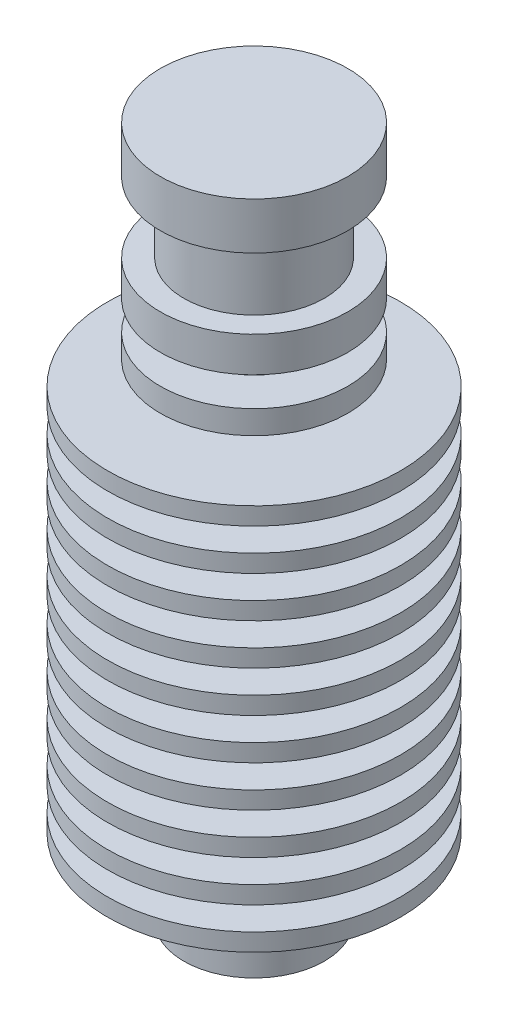
ISO-10303-21;
HEADER;
FILE_DESCRIPTION(('STEP AP214'),'2;1');
FILE_NAME('part.step','',(''),(''),'','','');
FILE_SCHEMA(('AUTOMOTIVE_DESIGN { 1 0 10303 214 1 1 1 1 }'));
ENDSEC;
DATA;
#1=APPLICATION_CONTEXT('core data for automotive mechanical design processes');
#2=APPLICATION_PROTOCOL_DEFINITION('international standard','automotive_design',2000,#1);
#3=PRODUCT_CONTEXT('',#1,'mechanical');
#4=PRODUCT('Part','Part','',(#3));
#5=PRODUCT_RELATED_PRODUCT_CATEGORY('part','',(#4));
#6=PRODUCT_DEFINITION_FORMATION('','',#4);
#7=PRODUCT_DEFINITION_CONTEXT('part definition',#1,'design');
#8=PRODUCT_DEFINITION('design','',#6,#7);
#9=PRODUCT_DEFINITION_SHAPE('','',#8);
#10=(LENGTH_UNIT() NAMED_UNIT(*) SI_UNIT(.MILLI.,.METRE.));
#11=(NAMED_UNIT(*) PLANE_ANGLE_UNIT() SI_UNIT($,.RADIAN.));
#12=(NAMED_UNIT(*) SI_UNIT($,.STERADIAN.) SOLID_ANGLE_UNIT());
#13=UNCERTAINTY_MEASURE_WITH_UNIT(LENGTH_MEASURE(1.E-05),#10,'distance_accuracy_value','');
#14=(GEOMETRIC_REPRESENTATION_CONTEXT(3) GLOBAL_UNCERTAINTY_ASSIGNED_CONTEXT((#13)) GLOBAL_UNIT_ASSIGNED_CONTEXT((#10,
#11,#12)) REPRESENTATION_CONTEXT('',''));
#15=CARTESIAN_POINT('',(0.,0.,0.));
#16=DIRECTION('',(0.,0.,1.));
#17=DIRECTION('',(1.,0.,0.));
#18=AXIS2_PLACEMENT_3D('',#15,#16,#17);
#19=CARTESIAN_POINT('',(0.,-29.5,0.));
#20=DIRECTION('',(0.,-1.,0.));
#21=DIRECTION('',(1.,0.,0.));
#22=AXIS2_PLACEMENT_3D('',#19,#20,#21);
#23=CYLINDRICAL_SURFACE('',#22,8.);
#24=CARTESIAN_POINT('',(0.,29.5,0.));
#25=DIRECTION('',(0.,-1.,0.));
#26=DIRECTION('',(1.,0.,0.));
#27=AXIS2_PLACEMENT_3D('',#24,#25,#26);
#28=CIRCLE('',#27,8.);
#29=CARTESIAN_POINT('',(7.99999999999999,29.5,0.));
#30=VERTEX_POINT('',#29);
#31=EDGE_CURVE('E200',#30,#30,#28,.T.);
#32=ORIENTED_EDGE('',*,*,#31,.T.);
#33=EDGE_LOOP('',(#32));
#34=FACE_BOUND('',#33,.T.);
#35=CARTESIAN_POINT('',(0.,25.5,0.));
#36=DIRECTION('',(0.,-1.,0.));
#37=DIRECTION('',(1.,0.,0.));
#38=AXIS2_PLACEMENT_3D('',#35,#36,#37);
#39=CIRCLE('',#38,8.);
#40=CARTESIAN_POINT('',(8.,25.5,0.));
#41=VERTEX_POINT('',#40);
#42=EDGE_CURVE('E10',#41,#41,#39,.T.);
#43=ORIENTED_EDGE('',*,*,#42,.F.);
#44=EDGE_LOOP('',(#43));
#45=FACE_BOUND('',#44,.T.);
#46=ADVANCED_FACE('F34',(#34,#45),#23,.T.);
#47=CARTESIAN_POINT('',(8.,25.5,0.));
#48=DIRECTION('',(0.,-1.,0.));
#49=DIRECTION('',(1.,0.,0.));
#50=AXIS2_PLACEMENT_3D('',#47,#48,#49);
#51=PLANE('',#50);
#52=ORIENTED_EDGE('',*,*,#42,.T.);
#53=EDGE_LOOP('',(#52));
#54=FACE_BOUND('',#53,.T.);
#55=CARTESIAN_POINT('',(0.,25.5,0.));
#56=DIRECTION('',(0.,-1.,0.));
#57=DIRECTION('',(1.,0.,0.));
#58=AXIS2_PLACEMENT_3D('',#55,#56,#57);
#59=CIRCLE('',#58,6.);
#60=CARTESIAN_POINT('',(5.99999999999999,25.5,0.));
#61=VERTEX_POINT('',#60);
#62=EDGE_CURVE('E40',#61,#61,#59,.T.);
#63=ORIENTED_EDGE('',*,*,#62,.F.);
#64=EDGE_LOOP('',(#63));
#65=FACE_BOUND('',#64,.T.);
#66=ADVANCED_FACE('F217',(#54,#65),#51,.T.);
#67=CARTESIAN_POINT('',(0.,-29.5,0.));
#68=DIRECTION('',(0.,-1.,0.));
#69=DIRECTION('',(1.,0.,0.));
#70=AXIS2_PLACEMENT_3D('',#67,#68,#69);
#71=CYLINDRICAL_SURFACE('',#70,6.);
#72=ORIENTED_EDGE('',*,*,#62,.T.);
#73=EDGE_LOOP('',(#72));
#74=FACE_BOUND('',#73,.T.);
#75=CARTESIAN_POINT('',(0.,19.5,0.));
#76=DIRECTION('',(0.,-1.,0.));
#77=DIRECTION('',(1.,0.,0.));
#78=AXIS2_PLACEMENT_3D('',#75,#76,#77);
#79=CIRCLE('',#78,6.);
#80=CARTESIAN_POINT('',(6.,19.5,0.));
#81=VERTEX_POINT('',#80);
#82=EDGE_CURVE('E44',#81,#81,#79,.T.);
#83=ORIENTED_EDGE('',*,*,#82,.F.);
#84=EDGE_LOOP('',(#83));
#85=FACE_BOUND('',#84,.T.);
#86=ADVANCED_FACE('F221',(#74,#85),#71,.T.);
#87=CARTESIAN_POINT('',(6.,19.5,0.));
#88=DIRECTION('',(0.,1.,0.));
#89=DIRECTION('',(-1.,0.,0.));
#90=AXIS2_PLACEMENT_3D('',#87,#88,#89);
#91=PLANE('',#90);
#92=ORIENTED_EDGE('',*,*,#82,.T.);
#93=EDGE_LOOP('',(#92));
#94=FACE_BOUND('',#93,.T.);
#95=CARTESIAN_POINT('',(0.,19.5,0.));
#96=DIRECTION('',(0.,-1.,0.));
#97=DIRECTION('',(1.,0.,0.));
#98=AXIS2_PLACEMENT_3D('',#95,#96,#97);
#99=CIRCLE('',#98,8.00000000000001);
#100=CARTESIAN_POINT('',(8.,19.5,0.));
#101=VERTEX_POINT('',#100);
#102=EDGE_CURVE('E48',#101,#101,#99,.T.);
#103=ORIENTED_EDGE('',*,*,#102,.F.);
#104=EDGE_LOOP('',(#103));
#105=FACE_BOUND('',#104,.T.);
#106=ADVANCED_FACE('F225',(#94,#105),#91,.T.);
#107=CARTESIAN_POINT('',(0.,-29.5,0.));
#108=DIRECTION('',(0.,-1.,0.));
#109=DIRECTION('',(1.,0.,0.));
#110=AXIS2_PLACEMENT_3D('',#107,#108,#109);
#111=CYLINDRICAL_SURFACE('',#110,8.00000000000001);
#112=ORIENTED_EDGE('',*,*,#102,.T.);
#113=EDGE_LOOP('',(#112));
#114=FACE_BOUND('',#113,.T.);
#115=CARTESIAN_POINT('',(0.,16.5,0.));
#116=DIRECTION('',(0.,-1.,0.));
#117=DIRECTION('',(1.,0.,0.));
#118=AXIS2_PLACEMENT_3D('',#115,#116,#117);
#119=CIRCLE('',#118,8.00000000000001);
#120=CARTESIAN_POINT('',(8.,16.5,0.));
#121=VERTEX_POINT('',#120);
#122=EDGE_CURVE('E53',#121,#121,#119,.T.);
#123=ORIENTED_EDGE('',*,*,#122,.F.);
#124=EDGE_LOOP('',(#123));
#125=FACE_BOUND('',#124,.T.);
#126=ADVANCED_FACE('F231',(#114,#125),#111,.T.);
#127=CARTESIAN_POINT('',(8.,16.5,0.));
#128=DIRECTION('',(0.,-1.,0.));
#129=DIRECTION('',(1.,0.,0.));
#130=AXIS2_PLACEMENT_3D('',#127,#128,#129);
#131=PLANE('',#130);
#132=ORIENTED_EDGE('',*,*,#122,.T.);
#133=EDGE_LOOP('',(#132));
#134=FACE_BOUND('',#133,.T.);
#135=CARTESIAN_POINT('',(0.,16.5,0.));
#136=DIRECTION('',(0.,-1.,0.));
#137=DIRECTION('',(1.,0.,0.));
#138=AXIS2_PLACEMENT_3D('',#135,#136,#137);
#139=CIRCLE('',#138,4.5);
#140=CARTESIAN_POINT('',(4.5,16.5,0.));
#141=VERTEX_POINT('',#140);
#142=EDGE_CURVE('E56',#141,#141,#139,.T.);
#143=ORIENTED_EDGE('',*,*,#142,.F.);
#144=EDGE_LOOP('',(#143));
#145=FACE_BOUND('',#144,.T.);
#146=ADVANCED_FACE('F235',(#134,#145),#131,.T.);
#147=CARTESIAN_POINT('',(0.,-29.5,0.));
#148=DIRECTION('',(0.,-1.,0.));
#149=DIRECTION('',(1.,0.,0.));
#150=AXIS2_PLACEMENT_3D('',#147,#148,#149);
#151=CYLINDRICAL_SURFACE('',#150,4.5);
#152=ORIENTED_EDGE('',*,*,#142,.T.);
#153=EDGE_LOOP('',(#152));
#154=FACE_BOUND('',#153,.T.);
#155=CARTESIAN_POINT('',(0.,14.,0.));
#156=DIRECTION('',(0.,-1.,0.));
#157=DIRECTION('',(1.,0.,0.));
#158=AXIS2_PLACEMENT_3D('',#155,#156,#157);
#159=CIRCLE('',#158,4.5);
#160=CARTESIAN_POINT('',(4.5,14.,0.));
#161=VERTEX_POINT('',#160);
#162=EDGE_CURVE('E59',#161,#161,#159,.T.);
#163=ORIENTED_EDGE('',*,*,#162,.F.);
#164=EDGE_LOOP('',(#163));
#165=FACE_BOUND('',#164,.T.);
#166=ADVANCED_FACE('F239',(#154,#165),#151,.T.);
#167=CARTESIAN_POINT('',(4.5,14.,0.));
#168=DIRECTION('',(0.,1.,0.));
#169=DIRECTION('',(-1.,0.,0.));
#170=AXIS2_PLACEMENT_3D('',#167,#168,#169);
#171=PLANE('',#170);
#172=ORIENTED_EDGE('',*,*,#162,.T.);
#173=EDGE_LOOP('',(#172));
#174=FACE_BOUND('',#173,.T.);
#175=CARTESIAN_POINT('',(0.,14.,0.));
#176=DIRECTION('',(0.,-1.,0.));
#177=DIRECTION('',(1.,0.,0.));
#178=AXIS2_PLACEMENT_3D('',#175,#176,#177);
#179=CIRCLE('',#178,8.00000000000001);
#180=CARTESIAN_POINT('',(8.,14.,0.));
#181=VERTEX_POINT('',#180);
#182=EDGE_CURVE('E62',#181,#181,#179,.T.);
#183=ORIENTED_EDGE('',*,*,#182,.F.);
#184=EDGE_LOOP('',(#183));
#185=FACE_BOUND('',#184,.T.);
#186=ADVANCED_FACE('F243',(#174,#185),#171,.T.);
#187=CARTESIAN_POINT('',(0.,-29.5,0.));
#188=DIRECTION('',(0.,-1.,0.));
#189=DIRECTION('',(1.,0.,0.));
#190=AXIS2_PLACEMENT_3D('',#187,#188,#189);
#191=CYLINDRICAL_SURFACE('',#190,8.00000000000001);
#192=ORIENTED_EDGE('',*,*,#182,.T.);
#193=EDGE_LOOP('',(#192));
#194=FACE_BOUND('',#193,.T.);
#195=CARTESIAN_POINT('',(0.,12.,0.));
#196=DIRECTION('',(0.,-1.,0.));
#197=DIRECTION('',(1.,0.,0.));
#198=AXIS2_PLACEMENT_3D('',#195,#196,#197);
#199=CIRCLE('',#198,8.00000000000001);
#200=CARTESIAN_POINT('',(8.,12.,0.));
#201=VERTEX_POINT('',#200);
#202=EDGE_CURVE('E65',#201,#201,#199,.T.);
#203=ORIENTED_EDGE('',*,*,#202,.F.);
#204=EDGE_LOOP('',(#203));
#205=FACE_BOUND('',#204,.T.);
#206=ADVANCED_FACE('F247',(#194,#205),#191,.T.);
#207=CARTESIAN_POINT('',(8.,12.,0.));
#208=DIRECTION('',(0.,-1.,0.));
#209=DIRECTION('',(1.,0.,0.));
#210=AXIS2_PLACEMENT_3D('',#207,#208,#209);
#211=PLANE('',#210);
#212=ORIENTED_EDGE('',*,*,#202,.T.);
#213=EDGE_LOOP('',(#212));
#214=FACE_BOUND('',#213,.T.);
#215=CARTESIAN_POINT('',(0.,12.,0.));
#216=DIRECTION('',(0.,-1.,0.));
#217=DIRECTION('',(1.,0.,0.));
#218=AXIS2_PLACEMENT_3D('',#215,#216,#217);
#219=CIRCLE('',#218,4.5);
#220=CARTESIAN_POINT('',(4.49999999999999,12.,0.));
#221=VERTEX_POINT('',#220);
#222=EDGE_CURVE('E68',#221,#221,#219,.T.);
#223=ORIENTED_EDGE('',*,*,#222,.F.);
#224=EDGE_LOOP('',(#223));
#225=FACE_BOUND('',#224,.T.);
#226=ADVANCED_FACE('F251',(#214,#225),#211,.T.);
#227=CARTESIAN_POINT('',(0.,-29.5,0.));
#228=DIRECTION('',(0.,-1.,0.));
#229=DIRECTION('',(1.,0.,0.));
#230=AXIS2_PLACEMENT_3D('',#227,#228,#229);
#231=CYLINDRICAL_SURFACE('',#230,4.5);
#232=ORIENTED_EDGE('',*,*,#222,.T.);
#233=EDGE_LOOP('',(#232));
#234=FACE_BOUND('',#233,.T.);
#235=CARTESIAN_POINT('',(0.,10.,0.));
#236=DIRECTION('',(0.,-1.,0.));
#237=DIRECTION('',(1.,0.,0.));
#238=AXIS2_PLACEMENT_3D('',#235,#236,#237);
#239=CIRCLE('',#238,4.5);
#240=CARTESIAN_POINT('',(4.49999999999999,10.,0.));
#241=VERTEX_POINT('',#240);
#242=EDGE_CURVE('E71',#241,#241,#239,.T.);
#243=ORIENTED_EDGE('',*,*,#242,.F.);
#244=EDGE_LOOP('',(#243));
#245=FACE_BOUND('',#244,.T.);
#246=ADVANCED_FACE('F255',(#234,#245),#231,.T.);
#247=CARTESIAN_POINT('',(4.49999999999999,10.,0.));
#248=DIRECTION('',(0.,1.,0.));
#249=DIRECTION('',(-1.,0.,0.));
#250=AXIS2_PLACEMENT_3D('',#247,#248,#249);
#251=PLANE('',#250);
#252=ORIENTED_EDGE('',*,*,#242,.T.);
#253=EDGE_LOOP('',(#252));
#254=FACE_BOUND('',#253,.T.);
#255=CARTESIAN_POINT('',(0.,10.,0.));
#256=DIRECTION('',(0.,-1.,0.));
#257=DIRECTION('',(1.,0.,0.));
#258=AXIS2_PLACEMENT_3D('',#255,#256,#257);
#259=CIRCLE('',#258,12.5);
#260=CARTESIAN_POINT('',(12.5,10.,0.));
#261=VERTEX_POINT('',#260);
#262=EDGE_CURVE('E74',#261,#261,#259,.T.);
#263=ORIENTED_EDGE('',*,*,#262,.F.);
#264=EDGE_LOOP('',(#263));
#265=FACE_BOUND('',#264,.T.);
#266=ADVANCED_FACE('F259',(#254,#265),#251,.T.);
#267=CARTESIAN_POINT('',(0.,-29.5,0.));
#268=DIRECTION('',(0.,-1.,0.));
#269=DIRECTION('',(1.,0.,0.));
#270=AXIS2_PLACEMENT_3D('',#267,#268,#269);
#271=CYLINDRICAL_SURFACE('',#270,12.5);
#272=ORIENTED_EDGE('',*,*,#262,.T.);
#273=EDGE_LOOP('',(#272));
#274=FACE_BOUND('',#273,.T.);
#275=CARTESIAN_POINT('',(0.,8.50000000000001,0.));
#276=DIRECTION('',(0.,-1.,0.));
#277=DIRECTION('',(1.,0.,0.));
#278=AXIS2_PLACEMENT_3D('',#275,#276,#277);
#279=CIRCLE('',#278,12.5);
#280=CARTESIAN_POINT('',(12.5,8.50000000000001,0.));
#281=VERTEX_POINT('',#280);
#282=EDGE_CURVE('E77',#281,#281,#279,.T.);
#283=ORIENTED_EDGE('',*,*,#282,.F.);
#284=EDGE_LOOP('',(#283));
#285=FACE_BOUND('',#284,.T.);
#286=ADVANCED_FACE('F263',(#274,#285),#271,.T.);
#287=CARTESIAN_POINT('',(12.5,8.50000000000001,0.));
#288=DIRECTION('',(0.,-1.,0.));
#289=DIRECTION('',(1.,0.,0.));
#290=AXIS2_PLACEMENT_3D('',#287,#288,#289);
#291=PLANE('',#290);
#292=ORIENTED_EDGE('',*,*,#282,.T.);
#293=EDGE_LOOP('',(#292));
#294=FACE_BOUND('',#293,.T.);
#295=CARTESIAN_POINT('',(0.,8.5,0.));
#296=DIRECTION('',(0.,-1.,0.));
#297=DIRECTION('',(1.,0.,0.));
#298=AXIS2_PLACEMENT_3D('',#295,#296,#297);
#299=CIRCLE('',#298,4.5);
#300=CARTESIAN_POINT('',(4.5,8.5,0.));
#301=VERTEX_POINT('',#300);
#302=EDGE_CURVE('E80',#301,#301,#299,.T.);
#303=ORIENTED_EDGE('',*,*,#302,.F.);
#304=EDGE_LOOP('',(#303));
#305=FACE_BOUND('',#304,.T.);
#306=ADVANCED_FACE('F267',(#294,#305),#291,.T.);
#307=CARTESIAN_POINT('',(0.,-29.5,0.));
#308=DIRECTION('',(0.,-1.,0.));
#309=DIRECTION('',(1.,0.,0.));
#310=AXIS2_PLACEMENT_3D('',#307,#308,#309);
#311=CYLINDRICAL_SURFACE('',#310,4.5);
#312=ORIENTED_EDGE('',*,*,#302,.T.);
#313=EDGE_LOOP('',(#312));
#314=FACE_BOUND('',#313,.T.);
#315=CARTESIAN_POINT('',(0.,6.5,0.));
#316=DIRECTION('',(0.,-1.,0.));
#317=DIRECTION('',(1.,0.,0.));
#318=AXIS2_PLACEMENT_3D('',#315,#316,#317);
#319=CIRCLE('',#318,4.5);
#320=CARTESIAN_POINT('',(4.5,6.5,0.));
#321=VERTEX_POINT('',#320);
#322=EDGE_CURVE('E83',#321,#321,#319,.T.);
#323=ORIENTED_EDGE('',*,*,#322,.F.);
#324=EDGE_LOOP('',(#323));
#325=FACE_BOUND('',#324,.T.);
#326=ADVANCED_FACE('F271',(#314,#325),#311,.T.);
#327=CARTESIAN_POINT('',(4.5,6.5,0.));
#328=DIRECTION('',(0.,1.,0.));
#329=DIRECTION('',(-1.,0.,0.));
#330=AXIS2_PLACEMENT_3D('',#327,#328,#329);
#331=PLANE('',#330);
#332=ORIENTED_EDGE('',*,*,#322,.T.);
#333=EDGE_LOOP('',(#332));
#334=FACE_BOUND('',#333,.T.);
#335=CARTESIAN_POINT('',(0.,6.5,0.));
#336=DIRECTION('',(0.,-1.,0.));
#337=DIRECTION('',(1.,0.,0.));
#338=AXIS2_PLACEMENT_3D('',#335,#336,#337);
#339=CIRCLE('',#338,12.5);
#340=CARTESIAN_POINT('',(12.5,6.5,0.));
#341=VERTEX_POINT('',#340);
#342=EDGE_CURVE('E86',#341,#341,#339,.T.);
#343=ORIENTED_EDGE('',*,*,#342,.F.);
#344=EDGE_LOOP('',(#343));
#345=FACE_BOUND('',#344,.T.);
#346=ADVANCED_FACE('F275',(#334,#345),#331,.T.);
#347=CARTESIAN_POINT('',(0.,-29.5,0.));
#348=DIRECTION('',(0.,-1.,0.));
#349=DIRECTION('',(1.,0.,0.));
#350=AXIS2_PLACEMENT_3D('',#347,#348,#349);
#351=CYLINDRICAL_SURFACE('',#350,12.5);
#352=ORIENTED_EDGE('',*,*,#342,.T.);
#353=EDGE_LOOP('',(#352));
#354=FACE_BOUND('',#353,.T.);
#355=CARTESIAN_POINT('',(0.,5.,0.));
#356=DIRECTION('',(0.,-1.,0.));
#357=DIRECTION('',(1.,0.,0.));
#358=AXIS2_PLACEMENT_3D('',#355,#356,#357);
#359=CIRCLE('',#358,12.5);
#360=CARTESIAN_POINT('',(12.5,5.,0.));
#361=VERTEX_POINT('',#360);
#362=EDGE_CURVE('E89',#361,#361,#359,.T.);
#363=ORIENTED_EDGE('',*,*,#362,.F.);
#364=EDGE_LOOP('',(#363));
#365=FACE_BOUND('',#364,.T.);
#366=ADVANCED_FACE('F279',(#354,#365),#351,.T.);
#367=CARTESIAN_POINT('',(12.5,5.,0.));
#368=DIRECTION('',(0.,-1.,0.));
#369=DIRECTION('',(1.,0.,0.));
#370=AXIS2_PLACEMENT_3D('',#367,#368,#369);
#371=PLANE('',#370);
#372=ORIENTED_EDGE('',*,*,#362,.T.);
#373=EDGE_LOOP('',(#372));
#374=FACE_BOUND('',#373,.T.);
#375=CARTESIAN_POINT('',(0.,5.,0.));
#376=DIRECTION('',(0.,-1.,0.));
#377=DIRECTION('',(1.,0.,0.));
#378=AXIS2_PLACEMENT_3D('',#375,#376,#377);
#379=CIRCLE('',#378,4.5);
#380=CARTESIAN_POINT('',(4.5,5.,0.));
#381=VERTEX_POINT('',#380);
#382=EDGE_CURVE('E92',#381,#381,#379,.T.);
#383=ORIENTED_EDGE('',*,*,#382,.F.);
#384=EDGE_LOOP('',(#383));
#385=FACE_BOUND('',#384,.T.);
#386=ADVANCED_FACE('F283',(#374,#385),#371,.T.);
#387=CARTESIAN_POINT('',(0.,-29.5,0.));
#388=DIRECTION('',(0.,-1.,0.));
#389=DIRECTION('',(1.,0.,0.));
#390=AXIS2_PLACEMENT_3D('',#387,#388,#389);
#391=CYLINDRICAL_SURFACE('',#390,4.5);
#392=ORIENTED_EDGE('',*,*,#382,.T.);
#393=EDGE_LOOP('',(#392));
#394=FACE_BOUND('',#393,.T.);
#395=CARTESIAN_POINT('',(0.,3.,0.));
#396=DIRECTION('',(0.,-1.,0.));
#397=DIRECTION('',(1.,0.,0.));
#398=AXIS2_PLACEMENT_3D('',#395,#396,#397);
#399=CIRCLE('',#398,4.5);
#400=CARTESIAN_POINT('',(4.5,3.,0.));
#401=VERTEX_POINT('',#400);
#402=EDGE_CURVE('E95',#401,#401,#399,.T.);
#403=ORIENTED_EDGE('',*,*,#402,.F.);
#404=EDGE_LOOP('',(#403));
#405=FACE_BOUND('',#404,.T.);
#406=ADVANCED_FACE('F287',(#394,#405),#391,.T.);
#407=CARTESIAN_POINT('',(4.5,3.,0.));
#408=DIRECTION('',(0.,1.,0.));
#409=DIRECTION('',(-1.,0.,0.));
#410=AXIS2_PLACEMENT_3D('',#407,#408,#409);
#411=PLANE('',#410);
#412=ORIENTED_EDGE('',*,*,#402,.T.);
#413=EDGE_LOOP('',(#412));
#414=FACE_BOUND('',#413,.T.);
#415=CARTESIAN_POINT('',(0.,3.,0.));
#416=DIRECTION('',(0.,-1.,0.));
#417=DIRECTION('',(1.,0.,0.));
#418=AXIS2_PLACEMENT_3D('',#415,#416,#417);
#419=CIRCLE('',#418,12.5);
#420=CARTESIAN_POINT('',(12.5,3.,0.));
#421=VERTEX_POINT('',#420);
#422=EDGE_CURVE('E98',#421,#421,#419,.T.);
#423=ORIENTED_EDGE('',*,*,#422,.F.);
#424=EDGE_LOOP('',(#423));
#425=FACE_BOUND('',#424,.T.);
#426=ADVANCED_FACE('F291',(#414,#425),#411,.T.);
#427=CARTESIAN_POINT('',(0.,-29.5,0.));
#428=DIRECTION('',(0.,-1.,0.));
#429=DIRECTION('',(1.,0.,0.));
#430=AXIS2_PLACEMENT_3D('',#427,#428,#429);
#431=CYLINDRICAL_SURFACE('',#430,12.5);
#432=ORIENTED_EDGE('',*,*,#422,.T.);
#433=EDGE_LOOP('',(#432));
#434=FACE_BOUND('',#433,.T.);
#435=CARTESIAN_POINT('',(0.,1.5,0.));
#436=DIRECTION('',(0.,-1.,0.));
#437=DIRECTION('',(1.,0.,0.));
#438=AXIS2_PLACEMENT_3D('',#435,#436,#437);
#439=CIRCLE('',#438,12.5);
#440=CARTESIAN_POINT('',(12.5,1.5,0.));
#441=VERTEX_POINT('',#440);
#442=EDGE_CURVE('E101',#441,#441,#439,.T.);
#443=ORIENTED_EDGE('',*,*,#442,.F.);
#444=EDGE_LOOP('',(#443));
#445=FACE_BOUND('',#444,.T.);
#446=ADVANCED_FACE('F295',(#434,#445),#431,.T.);
#447=CARTESIAN_POINT('',(12.5,1.5,0.));
#448=DIRECTION('',(0.,-1.,0.));
#449=DIRECTION('',(1.,0.,0.));
#450=AXIS2_PLACEMENT_3D('',#447,#448,#449);
#451=PLANE('',#450);
#452=ORIENTED_EDGE('',*,*,#442,.T.);
#453=EDGE_LOOP('',(#452));
#454=FACE_BOUND('',#453,.T.);
#455=CARTESIAN_POINT('',(0.,1.5,0.));
#456=DIRECTION('',(0.,-1.,0.));
#457=DIRECTION('',(1.,0.,0.));
#458=AXIS2_PLACEMENT_3D('',#455,#456,#457);
#459=CIRCLE('',#458,4.5);
#460=CARTESIAN_POINT('',(4.5,1.5,0.));
#461=VERTEX_POINT('',#460);
#462=EDGE_CURVE('E104',#461,#461,#459,.T.);
#463=ORIENTED_EDGE('',*,*,#462,.F.);
#464=EDGE_LOOP('',(#463));
#465=FACE_BOUND('',#464,.T.);
#466=ADVANCED_FACE('F299',(#454,#465),#451,.T.);
#467=CARTESIAN_POINT('',(0.,-29.5,0.));
#468=DIRECTION('',(0.,-1.,0.));
#469=DIRECTION('',(1.,0.,0.));
#470=AXIS2_PLACEMENT_3D('',#467,#468,#469);
#471=CYLINDRICAL_SURFACE('',#470,4.5);
#472=ORIENTED_EDGE('',*,*,#462,.T.);
#473=EDGE_LOOP('',(#472));
#474=FACE_BOUND('',#473,.T.);
#475=CARTESIAN_POINT('',(0.,-0.5,0.));
#476=DIRECTION('',(0.,-1.,0.));
#477=DIRECTION('',(1.,0.,0.));
#478=AXIS2_PLACEMENT_3D('',#475,#476,#477);
#479=CIRCLE('',#478,4.5);
#480=CARTESIAN_POINT('',(4.5,-0.5,0.));
#481=VERTEX_POINT('',#480);
#482=EDGE_CURVE('E107',#481,#481,#479,.T.);
#483=ORIENTED_EDGE('',*,*,#482,.F.);
#484=EDGE_LOOP('',(#483));
#485=FACE_BOUND('',#484,.T.);
#486=ADVANCED_FACE('F303',(#474,#485),#471,.T.);
#487=CARTESIAN_POINT('',(4.5,-0.5,0.));
#488=DIRECTION('',(0.,1.,0.));
#489=DIRECTION('',(-1.,0.,0.));
#490=AXIS2_PLACEMENT_3D('',#487,#488,#489);
#491=PLANE('',#490);
#492=ORIENTED_EDGE('',*,*,#482,.T.);
#493=EDGE_LOOP('',(#492));
#494=FACE_BOUND('',#493,.T.);
#495=CARTESIAN_POINT('',(0.,-0.5,0.));
#496=DIRECTION('',(0.,-1.,0.));
#497=DIRECTION('',(1.,0.,0.));
#498=AXIS2_PLACEMENT_3D('',#495,#496,#497);
#499=CIRCLE('',#498,12.5);
#500=CARTESIAN_POINT('',(12.5,-0.499999999999999,0.));
#501=VERTEX_POINT('',#500);
#502=EDGE_CURVE('E110',#501,#501,#499,.T.);
#503=ORIENTED_EDGE('',*,*,#502,.F.);
#504=EDGE_LOOP('',(#503));
#505=FACE_BOUND('',#504,.T.);
#506=ADVANCED_FACE('F307',(#494,#505),#491,.T.);
#507=CARTESIAN_POINT('',(0.,-29.5,0.));
#508=DIRECTION('',(0.,-1.,0.));
#509=DIRECTION('',(1.,0.,0.));
#510=AXIS2_PLACEMENT_3D('',#507,#508,#509);
#511=CYLINDRICAL_SURFACE('',#510,12.5);
#512=ORIENTED_EDGE('',*,*,#502,.T.);
#513=EDGE_LOOP('',(#512));
#514=FACE_BOUND('',#513,.T.);
#515=CARTESIAN_POINT('',(0.,-2.,0.));
#516=DIRECTION('',(0.,-1.,0.));
#517=DIRECTION('',(1.,0.,0.));
#518=AXIS2_PLACEMENT_3D('',#515,#516,#517);
#519=CIRCLE('',#518,12.5);
#520=CARTESIAN_POINT('',(12.5,-2.,0.));
#521=VERTEX_POINT('',#520);
#522=EDGE_CURVE('E113',#521,#521,#519,.T.);
#523=ORIENTED_EDGE('',*,*,#522,.F.);
#524=EDGE_LOOP('',(#523));
#525=FACE_BOUND('',#524,.T.);
#526=ADVANCED_FACE('F311',(#514,#525),#511,.T.);
#527=CARTESIAN_POINT('',(12.5,-2.,0.));
#528=DIRECTION('',(0.,-1.,0.));
#529=DIRECTION('',(1.,0.,0.));
#530=AXIS2_PLACEMENT_3D('',#527,#528,#529);
#531=PLANE('',#530);
#532=ORIENTED_EDGE('',*,*,#522,.T.);
#533=EDGE_LOOP('',(#532));
#534=FACE_BOUND('',#533,.T.);
#535=CARTESIAN_POINT('',(0.,-2.,0.));
#536=DIRECTION('',(0.,-1.,0.));
#537=DIRECTION('',(1.,0.,0.));
#538=AXIS2_PLACEMENT_3D('',#535,#536,#537);
#539=CIRCLE('',#538,6.5);
#540=CARTESIAN_POINT('',(6.5,-2.,0.));
#541=VERTEX_POINT('',#540);
#542=EDGE_CURVE('E116',#541,#541,#539,.T.);
#543=ORIENTED_EDGE('',*,*,#542,.F.);
#544=EDGE_LOOP('',(#543));
#545=FACE_BOUND('',#544,.T.);
#546=ADVANCED_FACE('F315',(#534,#545),#531,.T.);
#547=CARTESIAN_POINT('',(0.,-29.5,0.));
#548=DIRECTION('',(0.,-1.,0.));
#549=DIRECTION('',(1.,0.,0.));
#550=AXIS2_PLACEMENT_3D('',#547,#548,#549);
#551=CYLINDRICAL_SURFACE('',#550,6.5);
#552=ORIENTED_EDGE('',*,*,#542,.T.);
#553=EDGE_LOOP('',(#552));
#554=FACE_BOUND('',#553,.T.);
#555=CARTESIAN_POINT('',(0.,-4.,0.));
#556=DIRECTION('',(0.,-1.,0.));
#557=DIRECTION('',(1.,0.,0.));
#558=AXIS2_PLACEMENT_3D('',#555,#556,#557);
#559=CIRCLE('',#558,6.5);
#560=CARTESIAN_POINT('',(6.5,-4.,0.));
#561=VERTEX_POINT('',#560);
#562=EDGE_CURVE('E119',#561,#561,#559,.T.);
#563=ORIENTED_EDGE('',*,*,#562,.F.);
#564=EDGE_LOOP('',(#563));
#565=FACE_BOUND('',#564,.T.);
#566=ADVANCED_FACE('F319',(#554,#565),#551,.T.);
#567=CARTESIAN_POINT('',(6.5,-4.,0.));
#568=DIRECTION('',(0.,1.,0.));
#569=DIRECTION('',(-1.,0.,0.));
#570=AXIS2_PLACEMENT_3D('',#567,#568,#569);
#571=PLANE('',#570);
#572=ORIENTED_EDGE('',*,*,#562,.T.);
#573=EDGE_LOOP('',(#572));
#574=FACE_BOUND('',#573,.T.);
#575=CARTESIAN_POINT('',(0.,-4.,0.));
#576=DIRECTION('',(0.,-1.,0.));
#577=DIRECTION('',(1.,0.,0.));
#578=AXIS2_PLACEMENT_3D('',#575,#576,#577);
#579=CIRCLE('',#578,12.5);
#580=CARTESIAN_POINT('',(12.5,-4.,0.));
#581=VERTEX_POINT('',#580);
#582=EDGE_CURVE('E122',#581,#581,#579,.T.);
#583=ORIENTED_EDGE('',*,*,#582,.F.);
#584=EDGE_LOOP('',(#583));
#585=FACE_BOUND('',#584,.T.);
#586=ADVANCED_FACE('F323',(#574,#585),#571,.T.);
#587=CARTESIAN_POINT('',(0.,-29.5,0.));
#588=DIRECTION('',(0.,-1.,0.));
#589=DIRECTION('',(1.,0.,0.));
#590=AXIS2_PLACEMENT_3D('',#587,#588,#589);
#591=CYLINDRICAL_SURFACE('',#590,12.5);
#592=ORIENTED_EDGE('',*,*,#582,.T.);
#593=EDGE_LOOP('',(#592));
#594=FACE_BOUND('',#593,.T.);
#595=CARTESIAN_POINT('',(0.,-5.5,0.));
#596=DIRECTION('',(0.,-1.,0.));
#597=DIRECTION('',(1.,0.,0.));
#598=AXIS2_PLACEMENT_3D('',#595,#596,#597);
#599=CIRCLE('',#598,12.5);
#600=CARTESIAN_POINT('',(12.5,-5.5,0.));
#601=VERTEX_POINT('',#600);
#602=EDGE_CURVE('E125',#601,#601,#599,.T.);
#603=ORIENTED_EDGE('',*,*,#602,.F.);
#604=EDGE_LOOP('',(#603));
#605=FACE_BOUND('',#604,.T.);
#606=ADVANCED_FACE('F327',(#594,#605),#591,.T.);
#607=CARTESIAN_POINT('',(12.5,-5.5,0.));
#608=DIRECTION('',(0.,-1.,0.));
#609=DIRECTION('',(1.,0.,0.));
#610=AXIS2_PLACEMENT_3D('',#607,#608,#609);
#611=PLANE('',#610);
#612=ORIENTED_EDGE('',*,*,#602,.T.);
#613=EDGE_LOOP('',(#612));
#614=FACE_BOUND('',#613,.T.);
#615=CARTESIAN_POINT('',(0.,-5.5,0.));
#616=DIRECTION('',(0.,-1.,0.));
#617=DIRECTION('',(1.,0.,0.));
#618=AXIS2_PLACEMENT_3D('',#615,#616,#617);
#619=CIRCLE('',#618,7.5);
#620=CARTESIAN_POINT('',(7.5,-5.5,0.));
#621=VERTEX_POINT('',#620);
#622=EDGE_CURVE('E128',#621,#621,#619,.T.);
#623=ORIENTED_EDGE('',*,*,#622,.F.);
#624=EDGE_LOOP('',(#623));
#625=FACE_BOUND('',#624,.T.);
#626=ADVANCED_FACE('F331',(#614,#625),#611,.T.);
#627=CARTESIAN_POINT('',(0.,-29.5,0.));
#628=DIRECTION('',(0.,-1.,0.));
#629=DIRECTION('',(1.,0.,0.));
#630=AXIS2_PLACEMENT_3D('',#627,#628,#629);
#631=CYLINDRICAL_SURFACE('',#630,7.5);
#632=ORIENTED_EDGE('',*,*,#622,.T.);
#633=EDGE_LOOP('',(#632));
#634=FACE_BOUND('',#633,.T.);
#635=CARTESIAN_POINT('',(0.,-7.5,0.));
#636=DIRECTION('',(0.,-1.,0.));
#637=DIRECTION('',(1.,0.,0.));
#638=AXIS2_PLACEMENT_3D('',#635,#636,#637);
#639=CIRCLE('',#638,7.5);
#640=CARTESIAN_POINT('',(7.5,-7.5,0.));
#641=VERTEX_POINT('',#640);
#642=EDGE_CURVE('E131',#641,#641,#639,.T.);
#643=ORIENTED_EDGE('',*,*,#642,.F.);
#644=EDGE_LOOP('',(#643));
#645=FACE_BOUND('',#644,.T.);
#646=ADVANCED_FACE('F335',(#634,#645),#631,.T.);
#647=CARTESIAN_POINT('',(7.5,-7.50000000000001,0.));
#648=DIRECTION('',(0.,1.,0.));
#649=DIRECTION('',(-1.,0.,0.));
#650=AXIS2_PLACEMENT_3D('',#647,#648,#649);
#651=PLANE('',#650);
#652=ORIENTED_EDGE('',*,*,#642,.T.);
#653=EDGE_LOOP('',(#652));
#654=FACE_BOUND('',#653,.T.);
#655=CARTESIAN_POINT('',(0.,-7.5,0.));
#656=DIRECTION('',(0.,-1.,0.));
#657=DIRECTION('',(1.,0.,0.));
#658=AXIS2_PLACEMENT_3D('',#655,#656,#657);
#659=CIRCLE('',#658,12.5);
#660=CARTESIAN_POINT('',(12.5,-7.5,0.));
#661=VERTEX_POINT('',#660);
#662=EDGE_CURVE('E134',#661,#661,#659,.T.);
#663=ORIENTED_EDGE('',*,*,#662,.F.);
#664=EDGE_LOOP('',(#663));
#665=FACE_BOUND('',#664,.T.);
#666=ADVANCED_FACE('F339',(#654,#665),#651,.T.);
#667=CARTESIAN_POINT('',(0.,-29.5,0.));
#668=DIRECTION('',(0.,-1.,0.));
#669=DIRECTION('',(1.,0.,0.));
#670=AXIS2_PLACEMENT_3D('',#667,#668,#669);
#671=CYLINDRICAL_SURFACE('',#670,12.5);
#672=ORIENTED_EDGE('',*,*,#662,.T.);
#673=EDGE_LOOP('',(#672));
#674=FACE_BOUND('',#673,.T.);
#675=CARTESIAN_POINT('',(0.,-9.00000000000001,0.));
#676=DIRECTION('',(0.,-1.,0.));
#677=DIRECTION('',(1.,0.,0.));
#678=AXIS2_PLACEMENT_3D('',#675,#676,#677);
#679=CIRCLE('',#678,12.5);
#680=CARTESIAN_POINT('',(12.5,-9.,0.));
#681=VERTEX_POINT('',#680);
#682=EDGE_CURVE('E137',#681,#681,#679,.T.);
#683=ORIENTED_EDGE('',*,*,#682,.F.);
#684=EDGE_LOOP('',(#683));
#685=FACE_BOUND('',#684,.T.);
#686=ADVANCED_FACE('F343',(#674,#685),#671,.T.);
#687=CARTESIAN_POINT('',(12.5,-9.00000000000001,0.));
#688=DIRECTION('',(0.,-1.,0.));
#689=DIRECTION('',(1.,0.,0.));
#690=AXIS2_PLACEMENT_3D('',#687,#688,#689);
#691=PLANE('',#690);
#692=ORIENTED_EDGE('',*,*,#682,.T.);
#693=EDGE_LOOP('',(#692));
#694=FACE_BOUND('',#693,.T.);
#695=CARTESIAN_POINT('',(0.,-9.00000000000001,0.));
#696=DIRECTION('',(0.,-1.,0.));
#697=DIRECTION('',(1.,0.,0.));
#698=AXIS2_PLACEMENT_3D('',#695,#696,#697);
#699=CIRCLE('',#698,7.5);
#700=CARTESIAN_POINT('',(7.5,-9.,0.));
#701=VERTEX_POINT('',#700);
#702=EDGE_CURVE('E140',#701,#701,#699,.T.);
#703=ORIENTED_EDGE('',*,*,#702,.F.);
#704=EDGE_LOOP('',(#703));
#705=FACE_BOUND('',#704,.T.);
#706=ADVANCED_FACE('F347',(#694,#705),#691,.T.);
#707=CARTESIAN_POINT('',(0.,-29.5,0.));
#708=DIRECTION('',(0.,-1.,0.));
#709=DIRECTION('',(1.,0.,0.));
#710=AXIS2_PLACEMENT_3D('',#707,#708,#709);
#711=CYLINDRICAL_SURFACE('',#710,7.5);
#712=ORIENTED_EDGE('',*,*,#702,.T.);
#713=EDGE_LOOP('',(#712));
#714=FACE_BOUND('',#713,.T.);
#715=CARTESIAN_POINT('',(0.,-11.,0.));
#716=DIRECTION('',(0.,-1.,0.));
#717=DIRECTION('',(1.,0.,0.));
#718=AXIS2_PLACEMENT_3D('',#715,#716,#717);
#719=CIRCLE('',#718,7.5);
#720=CARTESIAN_POINT('',(7.5,-11.,0.));
#721=VERTEX_POINT('',#720);
#722=EDGE_CURVE('E143',#721,#721,#719,.T.);
#723=ORIENTED_EDGE('',*,*,#722,.F.);
#724=EDGE_LOOP('',(#723));
#725=FACE_BOUND('',#724,.T.);
#726=ADVANCED_FACE('F351',(#714,#725),#711,.T.);
#727=CARTESIAN_POINT('',(7.5,-11.,0.));
#728=DIRECTION('',(0.,1.,0.));
#729=DIRECTION('',(-1.,0.,0.));
#730=AXIS2_PLACEMENT_3D('',#727,#728,#729);
#731=PLANE('',#730);
#732=ORIENTED_EDGE('',*,*,#722,.T.);
#733=EDGE_LOOP('',(#732));
#734=FACE_BOUND('',#733,.T.);
#735=CARTESIAN_POINT('',(0.,-11.,0.));
#736=DIRECTION('',(0.,-1.,0.));
#737=DIRECTION('',(1.,0.,0.));
#738=AXIS2_PLACEMENT_3D('',#735,#736,#737);
#739=CIRCLE('',#738,12.5);
#740=CARTESIAN_POINT('',(12.5,-11.,0.));
#741=VERTEX_POINT('',#740);
#742=EDGE_CURVE('E146',#741,#741,#739,.T.);
#743=ORIENTED_EDGE('',*,*,#742,.F.);
#744=EDGE_LOOP('',(#743));
#745=FACE_BOUND('',#744,.T.);
#746=ADVANCED_FACE('F355',(#734,#745),#731,.T.);
#747=CARTESIAN_POINT('',(0.,-29.5,0.));
#748=DIRECTION('',(0.,-1.,0.));
#749=DIRECTION('',(1.,0.,0.));
#750=AXIS2_PLACEMENT_3D('',#747,#748,#749);
#751=CYLINDRICAL_SURFACE('',#750,12.5);
#752=ORIENTED_EDGE('',*,*,#742,.T.);
#753=EDGE_LOOP('',(#752));
#754=FACE_BOUND('',#753,.T.);
#755=CARTESIAN_POINT('',(0.,-12.5,0.));
#756=DIRECTION('',(0.,-1.,0.));
#757=DIRECTION('',(1.,0.,0.));
#758=AXIS2_PLACEMENT_3D('',#755,#756,#757);
#759=CIRCLE('',#758,12.5);
#760=CARTESIAN_POINT('',(12.5,-12.5,0.));
#761=VERTEX_POINT('',#760);
#762=EDGE_CURVE('E149',#761,#761,#759,.T.);
#763=ORIENTED_EDGE('',*,*,#762,.F.);
#764=EDGE_LOOP('',(#763));
#765=FACE_BOUND('',#764,.T.);
#766=ADVANCED_FACE('F359',(#754,#765),#751,.T.);
#767=CARTESIAN_POINT('',(12.5,-12.5,0.));
#768=DIRECTION('',(0.,-1.,0.));
#769=DIRECTION('',(1.,0.,0.));
#770=AXIS2_PLACEMENT_3D('',#767,#768,#769);
#771=PLANE('',#770);
#772=ORIENTED_EDGE('',*,*,#762,.T.);
#773=EDGE_LOOP('',(#772));
#774=FACE_BOUND('',#773,.T.);
#775=CARTESIAN_POINT('',(0.,-12.5,0.));
#776=DIRECTION('',(0.,-1.,0.));
#777=DIRECTION('',(1.,0.,0.));
#778=AXIS2_PLACEMENT_3D('',#775,#776,#777);
#779=CIRCLE('',#778,7.5);
#780=CARTESIAN_POINT('',(7.5,-12.5,0.));
#781=VERTEX_POINT('',#780);
#782=EDGE_CURVE('E152',#781,#781,#779,.T.);
#783=ORIENTED_EDGE('',*,*,#782,.F.);
#784=EDGE_LOOP('',(#783));
#785=FACE_BOUND('',#784,.T.);
#786=ADVANCED_FACE('F363',(#774,#785),#771,.T.);
#787=CARTESIAN_POINT('',(0.,-29.5,0.));
#788=DIRECTION('',(0.,-1.,0.));
#789=DIRECTION('',(1.,0.,0.));
#790=AXIS2_PLACEMENT_3D('',#787,#788,#789);
#791=CYLINDRICAL_SURFACE('',#790,7.5);
#792=ORIENTED_EDGE('',*,*,#782,.T.);
#793=EDGE_LOOP('',(#792));
#794=FACE_BOUND('',#793,.T.);
#795=CARTESIAN_POINT('',(0.,-14.5,0.));
#796=DIRECTION('',(0.,-1.,0.));
#797=DIRECTION('',(1.,0.,0.));
#798=AXIS2_PLACEMENT_3D('',#795,#796,#797);
#799=CIRCLE('',#798,7.5);
#800=CARTESIAN_POINT('',(7.5,-14.5,0.));
#801=VERTEX_POINT('',#800);
#802=EDGE_CURVE('E155',#801,#801,#799,.T.);
#803=ORIENTED_EDGE('',*,*,#802,.F.);
#804=EDGE_LOOP('',(#803));
#805=FACE_BOUND('',#804,.T.);
#806=ADVANCED_FACE('F367',(#794,#805),#791,.T.);
#807=CARTESIAN_POINT('',(7.5,-14.5,0.));
#808=DIRECTION('',(0.,1.,0.));
#809=DIRECTION('',(-1.,0.,0.));
#810=AXIS2_PLACEMENT_3D('',#807,#808,#809);
#811=PLANE('',#810);
#812=ORIENTED_EDGE('',*,*,#802,.T.);
#813=EDGE_LOOP('',(#812));
#814=FACE_BOUND('',#813,.T.);
#815=CARTESIAN_POINT('',(0.,-14.5,0.));
#816=DIRECTION('',(0.,-1.,0.));
#817=DIRECTION('',(1.,0.,0.));
#818=AXIS2_PLACEMENT_3D('',#815,#816,#817);
#819=CIRCLE('',#818,12.5);
#820=CARTESIAN_POINT('',(12.5,-14.5,0.));
#821=VERTEX_POINT('',#820);
#822=EDGE_CURVE('E158',#821,#821,#819,.T.);
#823=ORIENTED_EDGE('',*,*,#822,.F.);
#824=EDGE_LOOP('',(#823));
#825=FACE_BOUND('',#824,.T.);
#826=ADVANCED_FACE('F371',(#814,#825),#811,.T.);
#827=CARTESIAN_POINT('',(0.,-29.5,0.));
#828=DIRECTION('',(0.,-1.,0.));
#829=DIRECTION('',(1.,0.,0.));
#830=AXIS2_PLACEMENT_3D('',#827,#828,#829);
#831=CYLINDRICAL_SURFACE('',#830,12.5);
#832=ORIENTED_EDGE('',*,*,#822,.T.);
#833=EDGE_LOOP('',(#832));
#834=FACE_BOUND('',#833,.T.);
#835=CARTESIAN_POINT('',(0.,-16.,0.));
#836=DIRECTION('',(0.,-1.,0.));
#837=DIRECTION('',(1.,0.,0.));
#838=AXIS2_PLACEMENT_3D('',#835,#836,#837);
#839=CIRCLE('',#838,12.5);
#840=CARTESIAN_POINT('',(12.5,-16.,0.));
#841=VERTEX_POINT('',#840);
#842=EDGE_CURVE('E161',#841,#841,#839,.T.);
#843=ORIENTED_EDGE('',*,*,#842,.F.);
#844=EDGE_LOOP('',(#843));
#845=FACE_BOUND('',#844,.T.);
#846=ADVANCED_FACE('F375',(#834,#845),#831,.T.);
#847=CARTESIAN_POINT('',(12.5,-16.,0.));
#848=DIRECTION('',(0.,-1.,0.));
#849=DIRECTION('',(1.,0.,0.));
#850=AXIS2_PLACEMENT_3D('',#847,#848,#849);
#851=PLANE('',#850);
#852=ORIENTED_EDGE('',*,*,#842,.T.);
#853=EDGE_LOOP('',(#852));
#854=FACE_BOUND('',#853,.T.);
#855=CARTESIAN_POINT('',(0.,-16.,0.));
#856=DIRECTION('',(0.,-1.,0.));
#857=DIRECTION('',(1.,0.,0.));
#858=AXIS2_PLACEMENT_3D('',#855,#856,#857);
#859=CIRCLE('',#858,7.5);
#860=CARTESIAN_POINT('',(7.5,-16.,0.));
#861=VERTEX_POINT('',#860);
#862=EDGE_CURVE('E164',#861,#861,#859,.T.);
#863=ORIENTED_EDGE('',*,*,#862,.F.);
#864=EDGE_LOOP('',(#863));
#865=FACE_BOUND('',#864,.T.);
#866=ADVANCED_FACE('F379',(#854,#865),#851,.T.);
#867=CARTESIAN_POINT('',(0.,-29.5,0.));
#868=DIRECTION('',(0.,-1.,0.));
#869=DIRECTION('',(1.,0.,0.));
#870=AXIS2_PLACEMENT_3D('',#867,#868,#869);
#871=CYLINDRICAL_SURFACE('',#870,7.5);
#872=ORIENTED_EDGE('',*,*,#862,.T.);
#873=EDGE_LOOP('',(#872));
#874=FACE_BOUND('',#873,.T.);
#875=CARTESIAN_POINT('',(0.,-18.,0.));
#876=DIRECTION('',(0.,-1.,0.));
#877=DIRECTION('',(1.,0.,0.));
#878=AXIS2_PLACEMENT_3D('',#875,#876,#877);
#879=CIRCLE('',#878,7.5);
#880=CARTESIAN_POINT('',(7.5,-18.,0.));
#881=VERTEX_POINT('',#880);
#882=EDGE_CURVE('E167',#881,#881,#879,.T.);
#883=ORIENTED_EDGE('',*,*,#882,.F.);
#884=EDGE_LOOP('',(#883));
#885=FACE_BOUND('',#884,.T.);
#886=ADVANCED_FACE('F383',(#874,#885),#871,.T.);
#887=CARTESIAN_POINT('',(7.5,-18.,0.));
#888=DIRECTION('',(0.,1.,0.));
#889=DIRECTION('',(-1.,0.,0.));
#890=AXIS2_PLACEMENT_3D('',#887,#888,#889);
#891=PLANE('',#890);
#892=ORIENTED_EDGE('',*,*,#882,.T.);
#893=EDGE_LOOP('',(#892));
#894=FACE_BOUND('',#893,.T.);
#895=CARTESIAN_POINT('',(0.,-18.,0.));
#896=DIRECTION('',(0.,-1.,0.));
#897=DIRECTION('',(1.,0.,0.));
#898=AXIS2_PLACEMENT_3D('',#895,#896,#897);
#899=CIRCLE('',#898,12.5);
#900=CARTESIAN_POINT('',(12.5,-18.,0.));
#901=VERTEX_POINT('',#900);
#902=EDGE_CURVE('E170',#901,#901,#899,.T.);
#903=ORIENTED_EDGE('',*,*,#902,.F.);
#904=EDGE_LOOP('',(#903));
#905=FACE_BOUND('',#904,.T.);
#906=ADVANCED_FACE('F387',(#894,#905),#891,.T.);
#907=CARTESIAN_POINT('',(0.,-29.5,0.));
#908=DIRECTION('',(0.,-1.,0.));
#909=DIRECTION('',(1.,0.,0.));
#910=AXIS2_PLACEMENT_3D('',#907,#908,#909);
#911=CYLINDRICAL_SURFACE('',#910,12.5);
#912=ORIENTED_EDGE('',*,*,#902,.T.);
#913=EDGE_LOOP('',(#912));
#914=FACE_BOUND('',#913,.T.);
#915=CARTESIAN_POINT('',(0.,-19.5,0.));
#916=DIRECTION('',(0.,-1.,0.));
#917=DIRECTION('',(1.,0.,0.));
#918=AXIS2_PLACEMENT_3D('',#915,#916,#917);
#919=CIRCLE('',#918,12.5);
#920=CARTESIAN_POINT('',(12.5,-19.5,0.));
#921=VERTEX_POINT('',#920);
#922=EDGE_CURVE('E173',#921,#921,#919,.T.);
#923=ORIENTED_EDGE('',*,*,#922,.F.);
#924=EDGE_LOOP('',(#923));
#925=FACE_BOUND('',#924,.T.);
#926=ADVANCED_FACE('F391',(#914,#925),#911,.T.);
#927=CARTESIAN_POINT('',(12.5,-19.5,0.));
#928=DIRECTION('',(0.,-1.,0.));
#929=DIRECTION('',(1.,0.,0.));
#930=AXIS2_PLACEMENT_3D('',#927,#928,#929);
#931=PLANE('',#930);
#932=ORIENTED_EDGE('',*,*,#922,.T.);
#933=EDGE_LOOP('',(#932));
#934=FACE_BOUND('',#933,.T.);
#935=CARTESIAN_POINT('',(0.,-19.5,0.));
#936=DIRECTION('',(0.,-1.,0.));
#937=DIRECTION('',(1.,0.,0.));
#938=AXIS2_PLACEMENT_3D('',#935,#936,#937);
#939=CIRCLE('',#938,7.50000000000001);
#940=CARTESIAN_POINT('',(7.5,-19.5,0.));
#941=VERTEX_POINT('',#940);
#942=EDGE_CURVE('E176',#941,#941,#939,.T.);
#943=ORIENTED_EDGE('',*,*,#942,.F.);
#944=EDGE_LOOP('',(#943));
#945=FACE_BOUND('',#944,.T.);
#946=ADVANCED_FACE('F395',(#934,#945),#931,.T.);
#947=CARTESIAN_POINT('',(0.,-29.5,0.));
#948=DIRECTION('',(0.,-1.,0.));
#949=DIRECTION('',(1.,0.,0.));
#950=AXIS2_PLACEMENT_3D('',#947,#948,#949);
#951=CYLINDRICAL_SURFACE('',#950,7.50000000000001);
#952=ORIENTED_EDGE('',*,*,#942,.T.);
#953=EDGE_LOOP('',(#952));
#954=FACE_BOUND('',#953,.T.);
#955=CARTESIAN_POINT('',(0.,-21.5,0.));
#956=DIRECTION('',(0.,-1.,0.));
#957=DIRECTION('',(1.,0.,0.));
#958=AXIS2_PLACEMENT_3D('',#955,#956,#957);
#959=CIRCLE('',#958,7.50000000000001);
#960=CARTESIAN_POINT('',(7.5,-21.5,0.));
#961=VERTEX_POINT('',#960);
#962=EDGE_CURVE('E179',#961,#961,#959,.T.);
#963=ORIENTED_EDGE('',*,*,#962,.F.);
#964=EDGE_LOOP('',(#963));
#965=FACE_BOUND('',#964,.T.);
#966=ADVANCED_FACE('F399',(#954,#965),#951,.T.);
#967=CARTESIAN_POINT('',(7.5,-21.5,0.));
#968=DIRECTION('',(0.,1.,0.));
#969=DIRECTION('',(-1.,0.,0.));
#970=AXIS2_PLACEMENT_3D('',#967,#968,#969);
#971=PLANE('',#970);
#972=ORIENTED_EDGE('',*,*,#962,.T.);
#973=EDGE_LOOP('',(#972));
#974=FACE_BOUND('',#973,.T.);
#975=CARTESIAN_POINT('',(0.,-21.5,0.));
#976=DIRECTION('',(0.,-1.,0.));
#977=DIRECTION('',(1.,0.,0.));
#978=AXIS2_PLACEMENT_3D('',#975,#976,#977);
#979=CIRCLE('',#978,12.5);
#980=CARTESIAN_POINT('',(12.5,-21.5,0.));
#981=VERTEX_POINT('',#980);
#982=EDGE_CURVE('E182',#981,#981,#979,.T.);
#983=ORIENTED_EDGE('',*,*,#982,.F.);
#984=EDGE_LOOP('',(#983));
#985=FACE_BOUND('',#984,.T.);
#986=ADVANCED_FACE('F403',(#974,#985),#971,.T.);
#987=CARTESIAN_POINT('',(0.,-29.5,0.));
#988=DIRECTION('',(0.,-1.,0.));
#989=DIRECTION('',(1.,0.,0.));
#990=AXIS2_PLACEMENT_3D('',#987,#988,#989);
#991=CYLINDRICAL_SURFACE('',#990,12.5);
#992=ORIENTED_EDGE('',*,*,#982,.T.);
#993=EDGE_LOOP('',(#992));
#994=FACE_BOUND('',#993,.T.);
#995=CARTESIAN_POINT('',(0.,-23.,0.));
#996=DIRECTION('',(0.,-1.,0.));
#997=DIRECTION('',(1.,0.,0.));
#998=AXIS2_PLACEMENT_3D('',#995,#996,#997);
#999=CIRCLE('',#998,12.5);
#1000=CARTESIAN_POINT('',(12.5,-23.,0.));
#1001=VERTEX_POINT('',#1000);
#1002=EDGE_CURVE('E185',#1001,#1001,#999,.T.);
#1003=ORIENTED_EDGE('',*,*,#1002,.F.);
#1004=EDGE_LOOP('',(#1003));
#1005=FACE_BOUND('',#1004,.T.);
#1006=ADVANCED_FACE('F407',(#994,#1005),#991,.T.);
#1007=CARTESIAN_POINT('',(12.5,-23.,0.));
#1008=DIRECTION('',(0.,-1.,0.));
#1009=DIRECTION('',(1.,0.,0.));
#1010=AXIS2_PLACEMENT_3D('',#1007,#1008,#1009);
#1011=PLANE('',#1010);
#1012=ORIENTED_EDGE('',*,*,#1002,.T.);
#1013=EDGE_LOOP('',(#1012));
#1014=FACE_BOUND('',#1013,.T.);
#1015=CARTESIAN_POINT('',(0.,-23.,0.));
#1016=DIRECTION('',(0.,-1.,0.));
#1017=DIRECTION('',(1.,0.,0.));
#1018=AXIS2_PLACEMENT_3D('',#1015,#1016,#1017);
#1019=CIRCLE('',#1018,4.);
#1020=CARTESIAN_POINT('',(4.,-23.,0.));
#1021=VERTEX_POINT('',#1020);
#1022=EDGE_CURVE('E188',#1021,#1021,#1019,.T.);
#1023=ORIENTED_EDGE('',*,*,#1022,.F.);
#1024=EDGE_LOOP('',(#1023));
#1025=FACE_BOUND('',#1024,.T.);
#1026=ADVANCED_FACE('F411',(#1014,#1025),#1011,.T.);
#1027=CARTESIAN_POINT('',(0.,-29.5,0.));
#1028=DIRECTION('',(0.,-1.,0.));
#1029=DIRECTION('',(1.,0.,0.));
#1030=AXIS2_PLACEMENT_3D('',#1027,#1028,#1029);
#1031=CYLINDRICAL_SURFACE('',#1030,4.);
#1032=ORIENTED_EDGE('',*,*,#1022,.T.);
#1033=EDGE_LOOP('',(#1032));
#1034=FACE_BOUND('',#1033,.T.);
#1035=CARTESIAN_POINT('',(0.,-25.,0.));
#1036=DIRECTION('',(0.,-1.,0.));
#1037=DIRECTION('',(1.,0.,0.));
#1038=AXIS2_PLACEMENT_3D('',#1035,#1036,#1037);
#1039=CIRCLE('',#1038,4.);
#1040=CARTESIAN_POINT('',(4.,-25.,0.));
#1041=VERTEX_POINT('',#1040);
#1042=EDGE_CURVE('E191',#1041,#1041,#1039,.T.);
#1043=ORIENTED_EDGE('',*,*,#1042,.F.);
#1044=EDGE_LOOP('',(#1043));
#1045=FACE_BOUND('',#1044,.T.);
#1046=ADVANCED_FACE('F415',(#1034,#1045),#1031,.T.);
#1047=CARTESIAN_POINT('',(4.,-25.,0.));
#1048=DIRECTION('',(0.,1.,0.));
#1049=DIRECTION('',(-1.,0.,0.));
#1050=AXIS2_PLACEMENT_3D('',#1047,#1048,#1049);
#1051=PLANE('',#1050);
#1052=ORIENTED_EDGE('',*,*,#1042,.T.);
#1053=EDGE_LOOP('',(#1052));
#1054=FACE_BOUND('',#1053,.T.);
#1055=CARTESIAN_POINT('',(0.,-25.,0.));
#1056=DIRECTION('',(0.,-1.,0.));
#1057=DIRECTION('',(1.,0.,0.));
#1058=AXIS2_PLACEMENT_3D('',#1055,#1056,#1057);
#1059=CIRCLE('',#1058,6.);
#1060=CARTESIAN_POINT('',(6.,-25.,0.));
#1061=VERTEX_POINT('',#1060);
#1062=EDGE_CURVE('E194',#1061,#1061,#1059,.T.);
#1063=ORIENTED_EDGE('',*,*,#1062,.F.);
#1064=EDGE_LOOP('',(#1063));
#1065=FACE_BOUND('',#1064,.T.);
#1066=ADVANCED_FACE('F419',(#1054,#1065),#1051,.T.);
#1067=CARTESIAN_POINT('',(0.,-29.5,0.));
#1068=DIRECTION('',(0.,-1.,0.));
#1069=DIRECTION('',(1.,0.,0.));
#1070=AXIS2_PLACEMENT_3D('',#1067,#1068,#1069);
#1071=CYLINDRICAL_SURFACE('',#1070,6.);
#1072=ORIENTED_EDGE('',*,*,#1062,.T.);
#1073=EDGE_LOOP('',(#1072));
#1074=FACE_BOUND('',#1073,.T.);
#1075=CARTESIAN_POINT('',(0.,-29.5,0.));
#1076=DIRECTION('',(0.,-1.,0.));
#1077=DIRECTION('',(1.,0.,0.));
#1078=AXIS2_PLACEMENT_3D('',#1075,#1076,#1077);
#1079=CIRCLE('',#1078,6.);
#1080=CARTESIAN_POINT('',(6.,-29.5,0.));
#1081=VERTEX_POINT('',#1080);
#1082=EDGE_CURVE('E197',#1081,#1081,#1079,.T.);
#1083=ORIENTED_EDGE('',*,*,#1082,.F.);
#1084=EDGE_LOOP('',(#1083));
#1085=FACE_BOUND('',#1084,.T.);
#1086=ADVANCED_FACE('F213',(#1074,#1085),#1071,.T.);
#1087=CARTESIAN_POINT('',(6.,-29.5,0.));
#1088=DIRECTION('',(0.,-1.,0.));
#1089=DIRECTION('',(1.,0.,0.));
#1090=AXIS2_PLACEMENT_3D('',#1087,#1088,#1089);
#1091=PLANE('',#1090);
#1092=ORIENTED_EDGE('',*,*,#1082,.T.);
#1093=EDGE_LOOP('',(#1092));
#1094=FACE_BOUND('',#1093,.T.);
#1095=ADVANCED_FACE('F208',(#1094),#1091,.T.);
#1096=CARTESIAN_POINT('',(0.,29.5,0.));
#1097=DIRECTION('',(0.,1.,0.));
#1098=DIRECTION('',(-1.,0.,0.));
#1099=AXIS2_PLACEMENT_3D('',#1096,#1097,#1098);
#1100=PLANE('',#1099);
#1101=ORIENTED_EDGE('',*,*,#31,.F.);
#1102=EDGE_LOOP('',(#1101));
#1103=FACE_BOUND('',#1102,.T.);
#1104=ADVANCED_FACE('F206',(#1103),#1100,.T.);
#1105=CLOSED_SHELL('',(#46,#66,#86,#106,#126,#146,#166,#186,#206,#226,#246,#266,#286,#306,#326,
#346,#366,#386,#406,#426,#446,#466,#486,#506,#526,#546,#566,#586,#606,#626,#646,#666,#686,#706,
#726,#746,#766,#786,#806,#826,#846,#866,#886,#906,#926,#946,#966,#986,#1006,#1026,#1046,#1066,
#1086,#1095,#1104));
#1106=MANIFOLD_SOLID_BREP('B2',#1105);
#1107=ADVANCED_BREP_SHAPE_REPRESENTATION('',(#18,#1106),#14);
#1108=SHAPE_DEFINITION_REPRESENTATION(#9,#1107);
ENDSEC;
END-ISO-10303-21;
